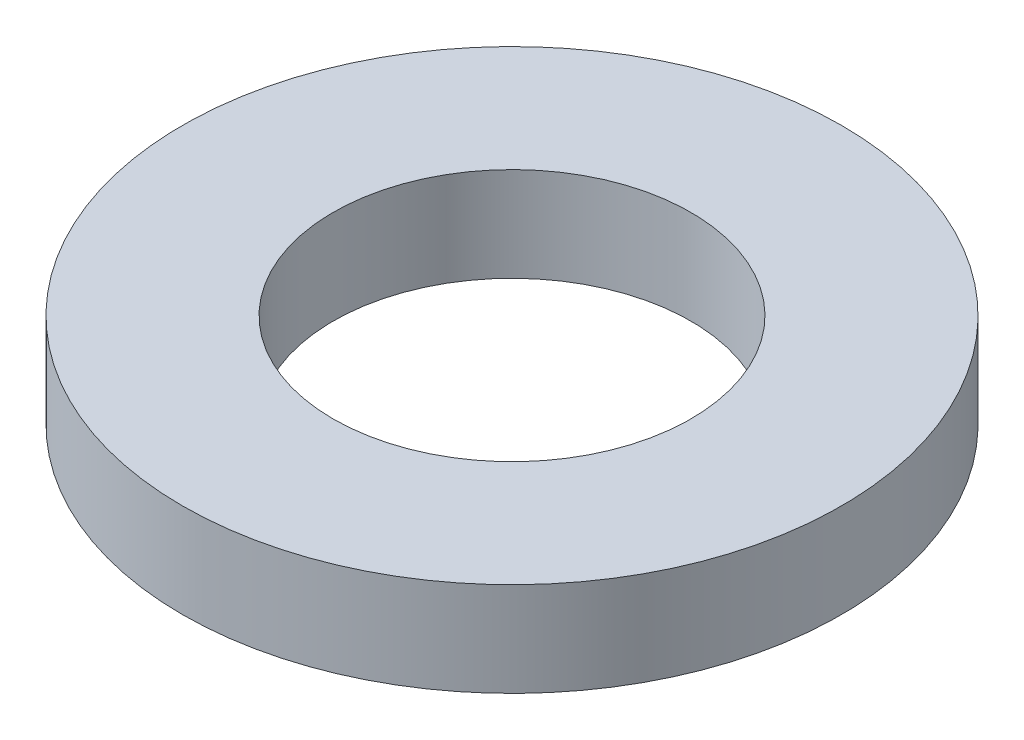
ISO-10303-21;
HEADER;
FILE_DESCRIPTION(('STEP AP214'),'2;1');
FILE_NAME('part.step','',(''),(''),'','','');
FILE_SCHEMA(('AUTOMOTIVE_DESIGN { 1 0 10303 214 1 1 1 1 }'));
ENDSEC;
DATA;
#1=APPLICATION_CONTEXT('core data for automotive mechanical design processes');
#2=APPLICATION_PROTOCOL_DEFINITION('international standard','automotive_design',2000,#1);
#3=PRODUCT_CONTEXT('',#1,'mechanical');
#4=PRODUCT('Part','Part','',(#3));
#5=PRODUCT_RELATED_PRODUCT_CATEGORY('part','',(#4));
#6=PRODUCT_DEFINITION_FORMATION('','',#4);
#7=PRODUCT_DEFINITION_CONTEXT('part definition',#1,'design');
#8=PRODUCT_DEFINITION('design','',#6,#7);
#9=PRODUCT_DEFINITION_SHAPE('','',#8);
#10=(LENGTH_UNIT() NAMED_UNIT(*) SI_UNIT(.MILLI.,.METRE.));
#11=(NAMED_UNIT(*) PLANE_ANGLE_UNIT() SI_UNIT($,.RADIAN.));
#12=(NAMED_UNIT(*) SI_UNIT($,.STERADIAN.) SOLID_ANGLE_UNIT());
#13=UNCERTAINTY_MEASURE_WITH_UNIT(LENGTH_MEASURE(1.E-05),#10,'distance_accuracy_value','');
#14=(GEOMETRIC_REPRESENTATION_CONTEXT(3) GLOBAL_UNCERTAINTY_ASSIGNED_CONTEXT((#13)) GLOBAL_UNIT_ASSIGNED_CONTEXT((#10,
#11,#12)) REPRESENTATION_CONTEXT('',''));
#15=CARTESIAN_POINT('',(0.,0.,0.));
#16=DIRECTION('',(0.,0.,1.));
#17=DIRECTION('',(1.,0.,0.));
#18=AXIS2_PLACEMENT_3D('',#15,#16,#17);
#19=CARTESIAN_POINT('',(0.,25.,0.));
#20=DIRECTION('',(0.,-1.,0.));
#21=DIRECTION('',(0.,0.,-1.));
#22=AXIS2_PLACEMENT_3D('',#19,#20,#21);
#23=CYLINDRICAL_SURFACE('',#22,87.5);
#24=CARTESIAN_POINT('',(0.,25.,0.));
#25=DIRECTION('',(0.,1.,0.));
#26=DIRECTION('',(0.,0.,1.));
#27=AXIS2_PLACEMENT_3D('',#24,#25,#26);
#28=CIRCLE('',#27,87.5);
#29=CARTESIAN_POINT('',(0.,25.,87.5));
#30=VERTEX_POINT('',#29);
#31=EDGE_CURVE('E10',#30,#30,#28,.T.);
#32=ORIENTED_EDGE('',*,*,#31,.F.);
#33=EDGE_LOOP('',(#32));
#34=FACE_BOUND('',#33,.T.);
#35=CARTESIAN_POINT('',(0.,0.,0.));
#36=DIRECTION('',(0.,1.,0.));
#37=DIRECTION('',(0.,0.,1.));
#38=AXIS2_PLACEMENT_3D('',#35,#36,#37);
#39=CIRCLE('',#38,87.5);
#40=CARTESIAN_POINT('',(0.,0.,87.5));
#41=VERTEX_POINT('',#40);
#42=EDGE_CURVE('E37',#41,#41,#39,.T.);
#43=ORIENTED_EDGE('',*,*,#42,.T.);
#44=EDGE_LOOP('',(#43));
#45=FACE_BOUND('',#44,.T.);
#46=ADVANCED_FACE('F40',(#34,#45),#23,.T.);
#47=CARTESIAN_POINT('',(0.,25.,0.));
#48=DIRECTION('',(0.,1.,0.));
#49=DIRECTION('',(0.,0.,1.));
#50=AXIS2_PLACEMENT_3D('',#47,#48,#49);
#51=PLANE('',#50);
#52=CARTESIAN_POINT('',(0.,25.,0.));
#53=DIRECTION('',(0.,1.,0.));
#54=DIRECTION('',(0.,0.,1.));
#55=AXIS2_PLACEMENT_3D('',#52,#53,#54);
#56=CIRCLE('',#55,47.5);
#57=CARTESIAN_POINT('',(0.,25.,47.5));
#58=VERTEX_POINT('',#57);
#59=EDGE_CURVE('E50',#58,#58,#56,.T.);
#60=ORIENTED_EDGE('',*,*,#59,.F.);
#61=EDGE_LOOP('',(#60));
#62=FACE_BOUND('',#61,.T.);
#63=ORIENTED_EDGE('',*,*,#31,.T.);
#64=EDGE_LOOP('',(#63));
#65=FACE_BOUND('',#64,.T.);
#66=ADVANCED_FACE('F59',(#62,#65),#51,.T.);
#67=CARTESIAN_POINT('',(0.,0.,0.));
#68=DIRECTION('',(0.,1.,0.));
#69=DIRECTION('',(0.,0.,1.));
#70=AXIS2_PLACEMENT_3D('',#67,#68,#69);
#71=PLANE('',#70);
#72=CARTESIAN_POINT('',(0.,0.,0.));
#73=DIRECTION('',(0.,1.,0.));
#74=DIRECTION('',(0.,0.,1.));
#75=AXIS2_PLACEMENT_3D('',#72,#73,#74);
#76=CIRCLE('',#75,47.5);
#77=CARTESIAN_POINT('',(0.,0.,47.5));
#78=VERTEX_POINT('',#77);
#79=EDGE_CURVE('E47',#78,#78,#76,.T.);
#80=ORIENTED_EDGE('',*,*,#79,.T.);
#81=EDGE_LOOP('',(#80));
#82=FACE_BOUND('',#81,.T.);
#83=ORIENTED_EDGE('',*,*,#42,.F.);
#84=EDGE_LOOP('',(#83));
#85=FACE_BOUND('',#84,.T.);
#86=ADVANCED_FACE('F58',(#82,#85),#71,.F.);
#87=CARTESIAN_POINT('',(0.,25.,0.));
#88=DIRECTION('',(0.,-1.,0.));
#89=DIRECTION('',(0.,0.,-1.));
#90=AXIS2_PLACEMENT_3D('',#87,#88,#89);
#91=CYLINDRICAL_SURFACE('',#90,47.5);
#92=ORIENTED_EDGE('',*,*,#59,.T.);
#93=EDGE_LOOP('',(#92));
#94=FACE_BOUND('',#93,.T.);
#95=ORIENTED_EDGE('',*,*,#79,.F.);
#96=EDGE_LOOP('',(#95));
#97=FACE_BOUND('',#96,.T.);
#98=ADVANCED_FACE('F54',(#94,#97),#91,.F.);
#99=CLOSED_SHELL('',(#46,#66,#86,#98));
#100=MANIFOLD_SOLID_BREP('B2',#99);
#101=ADVANCED_BREP_SHAPE_REPRESENTATION('',(#18,#100),#14);
#102=SHAPE_DEFINITION_REPRESENTATION(#9,#101);
ENDSEC;
END-ISO-10303-21;
